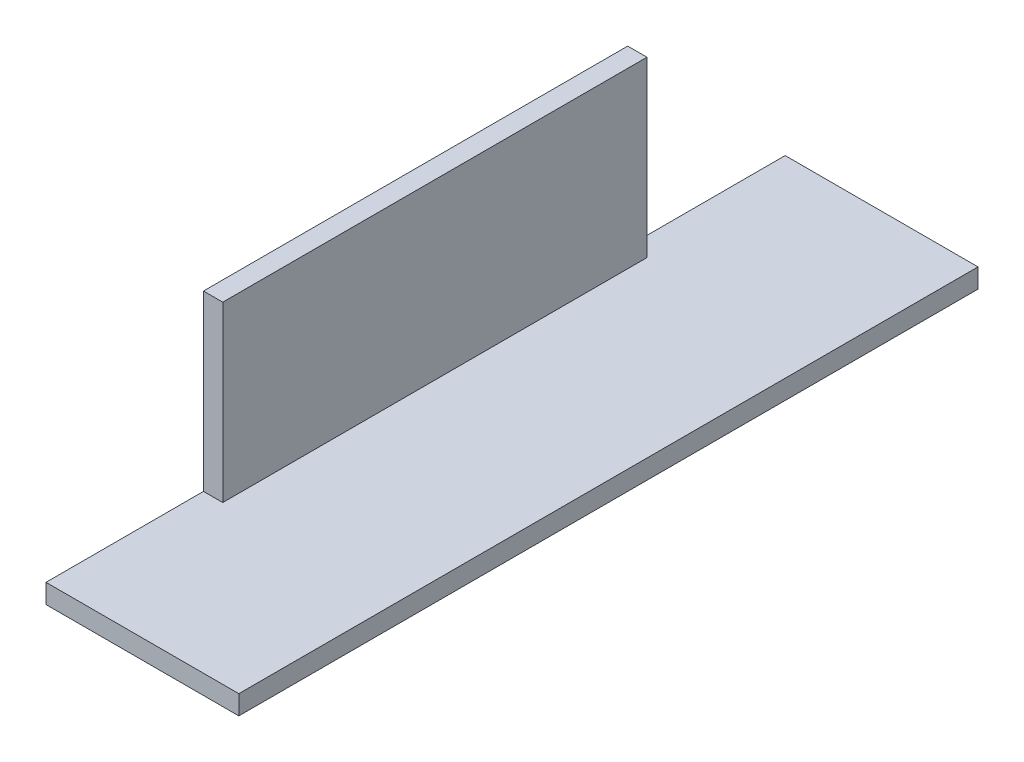
ISO-10303-21;
HEADER;
FILE_DESCRIPTION(('STEP AP214'),'2;1');
FILE_NAME('part.step','',(''),(''),'','','');
FILE_SCHEMA(('AUTOMOTIVE_DESIGN { 1 0 10303 214 1 1 1 1 }'));
ENDSEC;
DATA;
#1=APPLICATION_CONTEXT('core data for automotive mechanical design processes');
#2=APPLICATION_PROTOCOL_DEFINITION('international standard','automotive_design',2000,#1);
#3=PRODUCT_CONTEXT('',#1,'mechanical');
#4=PRODUCT('Part','Part','',(#3));
#5=PRODUCT_RELATED_PRODUCT_CATEGORY('part','',(#4));
#6=PRODUCT_DEFINITION_FORMATION('','',#4);
#7=PRODUCT_DEFINITION_CONTEXT('part definition',#1,'design');
#8=PRODUCT_DEFINITION('design','',#6,#7);
#9=PRODUCT_DEFINITION_SHAPE('','',#8);
#10=(LENGTH_UNIT() NAMED_UNIT(*) SI_UNIT(.MILLI.,.METRE.));
#11=(NAMED_UNIT(*) PLANE_ANGLE_UNIT() SI_UNIT($,.RADIAN.));
#12=(NAMED_UNIT(*) SI_UNIT($,.STERADIAN.) SOLID_ANGLE_UNIT());
#13=UNCERTAINTY_MEASURE_WITH_UNIT(LENGTH_MEASURE(1.E-05),#10,'distance_accuracy_value','');
#14=(GEOMETRIC_REPRESENTATION_CONTEXT(3) GLOBAL_UNCERTAINTY_ASSIGNED_CONTEXT((#13)) GLOBAL_UNIT_ASSIGNED_CONTEXT((#10,
#11,#12)) REPRESENTATION_CONTEXT('',''));
#15=CARTESIAN_POINT('',(0.,0.,0.));
#16=DIRECTION('',(0.,0.,1.));
#17=DIRECTION('',(1.,0.,0.));
#18=AXIS2_PLACEMENT_3D('',#15,#16,#17);
#19=CARTESIAN_POINT('',(0.,30.,115.));
#20=DIRECTION('',(0.,-1.,0.));
#21=DIRECTION('',(0.,0.,-1.));
#22=AXIS2_PLACEMENT_3D('',#19,#20,#21);
#23=PLANE('',#22);
#24=DIRECTION('',(0.,0.,-1.));
#25=VECTOR('',#24,1.);
#26=CARTESIAN_POINT('',(3.,30.,115.));
#27=LINE('',#26,#25);
#28=CARTESIAN_POINT('',(3.,30.,90.5));
#29=VERTEX_POINT('',#28);
#30=CARTESIAN_POINT('',(3.,30.,24.5));
#31=VERTEX_POINT('',#30);
#32=EDGE_CURVE('E145',#29,#31,#27,.T.);
#33=ORIENTED_EDGE('',*,*,#32,.T.);
#34=DIRECTION('',(-1.,0.,0.));
#35=VECTOR('',#34,1.);
#36=CARTESIAN_POINT('',(30.,30.,24.5));
#37=LINE('',#36,#35);
#38=CARTESIAN_POINT('',(0.,30.,24.5));
#39=VERTEX_POINT('',#38);
#40=EDGE_CURVE('E132',#31,#39,#37,.T.);
#41=ORIENTED_EDGE('',*,*,#40,.T.);
#42=DIRECTION('',(0.,0.,-1.));
#43=VECTOR('',#42,1.);
#44=CARTESIAN_POINT('',(0.,30.,115.));
#45=LINE('',#44,#43);
#46=CARTESIAN_POINT('',(0.,30.,90.5));
#47=VERTEX_POINT('',#46);
#48=EDGE_CURVE('E162',#47,#39,#45,.T.);
#49=ORIENTED_EDGE('',*,*,#48,.F.);
#50=DIRECTION('',(-1.,0.,0.));
#51=VECTOR('',#50,1.);
#52=CARTESIAN_POINT('',(30.,30.,90.5));
#53=LINE('',#52,#51);
#54=EDGE_CURVE('E185',#29,#47,#53,.T.);
#55=ORIENTED_EDGE('',*,*,#54,.F.);
#56=EDGE_LOOP('',(#33,#41,#49,#55));
#57=FACE_BOUND('',#56,.T.);
#58=ADVANCED_FACE('F38',(#57),#23,.F.);
#59=CARTESIAN_POINT('',(0.,30.,115.));
#60=DIRECTION('',(1.,0.,0.));
#61=DIRECTION('',(0.,1.,0.));
#62=AXIS2_PLACEMENT_3D('',#59,#60,#61);
#63=PLANE('',#62);
#64=ORIENTED_EDGE('',*,*,#48,.T.);
#65=DIRECTION('',(0.,1.,0.));
#66=VECTOR('',#65,1.);
#67=CARTESIAN_POINT('',(0.,30.,24.5));
#68=LINE('',#67,#66);
#69=CARTESIAN_POINT('',(0.,3.,24.5));
#70=VERTEX_POINT('',#69);
#71=EDGE_CURVE('E124',#70,#39,#68,.T.);
#72=ORIENTED_EDGE('',*,*,#71,.F.);
#73=DIRECTION('',(0.,0.,1.));
#74=VECTOR('',#73,1.);
#75=CARTESIAN_POINT('',(0.,3.,0.));
#76=LINE('',#75,#74);
#77=CARTESIAN_POINT('',(0.,3.,0.));
#78=VERTEX_POINT('',#77);
#79=EDGE_CURVE('E111',#78,#70,#76,.T.);
#80=ORIENTED_EDGE('',*,*,#79,.F.);
#81=DIRECTION('',(0.,-1.,0.));
#82=VECTOR('',#81,1.);
#83=CARTESIAN_POINT('',(0.,30.,0.));
#84=LINE('',#83,#82);
#85=CARTESIAN_POINT('',(0.,0.,0.));
#86=VERTEX_POINT('',#85);
#87=EDGE_CURVE('E122',#78,#86,#84,.T.);
#88=ORIENTED_EDGE('',*,*,#87,.T.);
#89=DIRECTION('',(0.,0.,-1.));
#90=VECTOR('',#89,1.);
#91=CARTESIAN_POINT('',(0.,0.,115.));
#92=LINE('',#91,#90);
#93=CARTESIAN_POINT('',(0.,0.,115.));
#94=VERTEX_POINT('',#93);
#95=EDGE_CURVE('E159',#94,#86,#92,.T.);
#96=ORIENTED_EDGE('',*,*,#95,.F.);
#97=DIRECTION('',(0.,-1.,0.));
#98=VECTOR('',#97,1.);
#99=CARTESIAN_POINT('',(0.,30.,115.));
#100=LINE('',#99,#98);
#101=CARTESIAN_POINT('',(0.,3.00000000000001,115.));
#102=VERTEX_POINT('',#101);
#103=EDGE_CURVE('E78',#102,#94,#100,.T.);
#104=ORIENTED_EDGE('',*,*,#103,.F.);
#105=DIRECTION('',(0.,0.,1.));
#106=VECTOR('',#105,1.);
#107=CARTESIAN_POINT('',(0.,3.00000000000003,115.));
#108=LINE('',#107,#106);
#109=CARTESIAN_POINT('',(0.,3.00000000000001,90.5));
#110=VERTEX_POINT('',#109);
#111=EDGE_CURVE('E182',#110,#102,#108,.T.);
#112=ORIENTED_EDGE('',*,*,#111,.F.);
#113=DIRECTION('',(0.,-1.,0.));
#114=VECTOR('',#113,1.);
#115=CARTESIAN_POINT('',(0.,30.,90.5));
#116=LINE('',#115,#114);
#117=EDGE_CURVE('E179',#47,#110,#116,.T.);
#118=ORIENTED_EDGE('',*,*,#117,.F.);
#119=EDGE_LOOP('',(#64,#72,#80,#88,#96,#104,#112,#118));
#120=FACE_BOUND('',#119,.T.);
#121=ADVANCED_FACE('F121',(#120),#63,.F.);
#122=CARTESIAN_POINT('',(0.,0.,115.));
#123=DIRECTION('',(0.,1.,0.));
#124=DIRECTION('',(0.,0.,1.));
#125=AXIS2_PLACEMENT_3D('',#122,#123,#124);
#126=PLANE('',#125);
#127=DIRECTION('',(1.,0.,0.));
#128=VECTOR('',#127,1.);
#129=CARTESIAN_POINT('',(0.,0.,0.));
#130=LINE('',#129,#128);
#131=CARTESIAN_POINT('',(30.,0.,0.));
#132=VERTEX_POINT('',#131);
#133=EDGE_CURVE('E130',#86,#132,#130,.T.);
#134=ORIENTED_EDGE('',*,*,#133,.T.);
#135=DIRECTION('',(0.,0.,-1.));
#136=VECTOR('',#135,1.);
#137=CARTESIAN_POINT('',(30.,0.,115.));
#138=LINE('',#137,#136);
#139=CARTESIAN_POINT('',(30.,0.,115.));
#140=VERTEX_POINT('',#139);
#141=EDGE_CURVE('E155',#140,#132,#138,.T.);
#142=ORIENTED_EDGE('',*,*,#141,.F.);
#143=DIRECTION('',(1.,0.,0.));
#144=VECTOR('',#143,1.);
#145=CARTESIAN_POINT('',(0.,0.,115.));
#146=LINE('',#145,#144);
#147=EDGE_CURVE('E192',#94,#140,#146,.T.);
#148=ORIENTED_EDGE('',*,*,#147,.F.);
#149=ORIENTED_EDGE('',*,*,#95,.T.);
#150=EDGE_LOOP('',(#134,#142,#148,#149));
#151=FACE_BOUND('',#150,.T.);
#152=ADVANCED_FACE('F200',(#151),#126,.F.);
#153=CARTESIAN_POINT('',(30.,3.,115.));
#154=DIRECTION('',(-1.,0.,0.));
#155=DIRECTION('',(0.,0.,1.));
#156=AXIS2_PLACEMENT_3D('',#153,#154,#155);
#157=PLANE('',#156);
#158=DIRECTION('',(0.,1.,0.));
#159=VECTOR('',#158,1.);
#160=CARTESIAN_POINT('',(30.,3.,0.));
#161=LINE('',#160,#159);
#162=CARTESIAN_POINT('',(30.,3.,0.));
#163=VERTEX_POINT('',#162);
#164=EDGE_CURVE('E117',#132,#163,#161,.T.);
#165=ORIENTED_EDGE('',*,*,#164,.T.);
#166=DIRECTION('',(0.,0.,-1.));
#167=VECTOR('',#166,1.);
#168=CARTESIAN_POINT('',(30.,3.,115.));
#169=LINE('',#168,#167);
#170=CARTESIAN_POINT('',(30.,3.,115.));
#171=VERTEX_POINT('',#170);
#172=EDGE_CURVE('E75',#171,#163,#169,.T.);
#173=ORIENTED_EDGE('',*,*,#172,.F.);
#174=DIRECTION('',(0.,1.,0.));
#175=VECTOR('',#174,1.);
#176=CARTESIAN_POINT('',(30.,3.,115.));
#177=LINE('',#176,#175);
#178=EDGE_CURVE('E59',#140,#171,#177,.T.);
#179=ORIENTED_EDGE('',*,*,#178,.F.);
#180=ORIENTED_EDGE('',*,*,#141,.T.);
#181=EDGE_LOOP('',(#165,#173,#179,#180));
#182=FACE_BOUND('',#181,.T.);
#183=ADVANCED_FACE('F202',(#182),#157,.F.);
#184=CARTESIAN_POINT('',(3.,3.,115.));
#185=DIRECTION('',(0.,-1.,0.));
#186=DIRECTION('',(0.,0.,-1.));
#187=AXIS2_PLACEMENT_3D('',#184,#185,#186);
#188=PLANE('',#187);
#189=ORIENTED_EDGE('',*,*,#172,.T.);
#190=DIRECTION('',(-1.,0.,0.));
#191=VECTOR('',#190,1.);
#192=CARTESIAN_POINT('',(3.,3.,0.));
#193=LINE('',#192,#191);
#194=EDGE_CURVE('E107',#163,#78,#193,.T.);
#195=ORIENTED_EDGE('',*,*,#194,.T.);
#196=ORIENTED_EDGE('',*,*,#79,.T.);
#197=DIRECTION('',(-1.,0.,0.));
#198=VECTOR('',#197,1.);
#199=CARTESIAN_POINT('',(30.,3.,24.5));
#200=LINE('',#199,#198);
#201=CARTESIAN_POINT('',(3.,3.,24.5));
#202=VERTEX_POINT('',#201);
#203=EDGE_CURVE('E138',#202,#70,#200,.T.);
#204=ORIENTED_EDGE('',*,*,#203,.F.);
#205=DIRECTION('',(0.,0.,-1.));
#206=VECTOR('',#205,1.);
#207=CARTESIAN_POINT('',(3.,3.,115.));
#208=LINE('',#207,#206);
#209=CARTESIAN_POINT('',(3.,3.00000000000001,90.5));
#210=VERTEX_POINT('',#209);
#211=EDGE_CURVE('E149',#210,#202,#208,.T.);
#212=ORIENTED_EDGE('',*,*,#211,.F.);
#213=DIRECTION('',(-1.,0.,0.));
#214=VECTOR('',#213,1.);
#215=CARTESIAN_POINT('',(30.,3.00000000000001,90.5));
#216=LINE('',#215,#214);
#217=EDGE_CURVE('E126',#210,#110,#216,.T.);
#218=ORIENTED_EDGE('',*,*,#217,.T.);
#219=ORIENTED_EDGE('',*,*,#111,.T.);
#220=DIRECTION('',(-1.,0.,0.));
#221=VECTOR('',#220,1.);
#222=CARTESIAN_POINT('',(3.,3.,115.));
#223=LINE('',#222,#221);
#224=EDGE_CURVE('E53',#171,#102,#223,.T.);
#225=ORIENTED_EDGE('',*,*,#224,.F.);
#226=EDGE_LOOP('',(#189,#195,#196,#204,#212,#218,#219,#225));
#227=FACE_BOUND('',#226,.T.);
#228=ADVANCED_FACE('F109',(#227),#188,.F.);
#229=CARTESIAN_POINT('',(3.,30.,115.));
#230=DIRECTION('',(-1.,0.,0.));
#231=DIRECTION('',(0.,-1.,0.));
#232=AXIS2_PLACEMENT_3D('',#229,#230,#231);
#233=PLANE('',#232);
#234=ORIENTED_EDGE('',*,*,#211,.T.);
#235=DIRECTION('',(0.,1.,0.));
#236=VECTOR('',#235,1.);
#237=CARTESIAN_POINT('',(3.,30.,24.5));
#238=LINE('',#237,#236);
#239=EDGE_CURVE('E11',#202,#31,#238,.T.);
#240=ORIENTED_EDGE('',*,*,#239,.T.);
#241=ORIENTED_EDGE('',*,*,#32,.F.);
#242=DIRECTION('',(0.,-1.,0.));
#243=VECTOR('',#242,1.);
#244=CARTESIAN_POINT('',(3.,30.,90.5));
#245=LINE('',#244,#243);
#246=EDGE_CURVE('E46',#29,#210,#245,.T.);
#247=ORIENTED_EDGE('',*,*,#246,.T.);
#248=EDGE_LOOP('',(#234,#240,#241,#247));
#249=FACE_BOUND('',#248,.T.);
#250=ADVANCED_FACE('F169',(#249),#233,.F.);
#251=CARTESIAN_POINT('',(0.,0.,115.));
#252=DIRECTION('',(0.,0.,-1.));
#253=DIRECTION('',(-1.,0.,0.));
#254=AXIS2_PLACEMENT_3D('',#251,#252,#253);
#255=PLANE('',#254);
#256=ORIENTED_EDGE('',*,*,#224,.T.);
#257=ORIENTED_EDGE('',*,*,#103,.T.);
#258=ORIENTED_EDGE('',*,*,#147,.T.);
#259=ORIENTED_EDGE('',*,*,#178,.T.);
#260=EDGE_LOOP('',(#256,#257,#258,#259));
#261=FACE_BOUND('',#260,.T.);
#262=ADVANCED_FACE('F198',(#261),#255,.F.);
#263=CARTESIAN_POINT('',(0.,0.,0.));
#264=DIRECTION('',(0.,0.,-1.));
#265=DIRECTION('',(-1.,0.,0.));
#266=AXIS2_PLACEMENT_3D('',#263,#264,#265);
#267=PLANE('',#266);
#268=ORIENTED_EDGE('',*,*,#87,.F.);
#269=ORIENTED_EDGE('',*,*,#194,.F.);
#270=ORIENTED_EDGE('',*,*,#164,.F.);
#271=ORIENTED_EDGE('',*,*,#133,.F.);
#272=EDGE_LOOP('',(#268,#269,#270,#271));
#273=FACE_BOUND('',#272,.T.);
#274=ADVANCED_FACE('F129',(#273),#267,.T.);
#275=CARTESIAN_POINT('',(30.,30.,24.5));
#276=DIRECTION('',(0.,0.,1.));
#277=DIRECTION('',(0.,-1.,0.));
#278=AXIS2_PLACEMENT_3D('',#275,#276,#277);
#279=PLANE('',#278);
#280=ORIENTED_EDGE('',*,*,#203,.T.);
#281=ORIENTED_EDGE('',*,*,#71,.T.);
#282=ORIENTED_EDGE('',*,*,#40,.F.);
#283=ORIENTED_EDGE('',*,*,#239,.F.);
#284=EDGE_LOOP('',(#280,#281,#282,#283));
#285=FACE_BOUND('',#284,.T.);
#286=ADVANCED_FACE('F207',(#285),#279,.F.);
#287=CARTESIAN_POINT('',(30.,30.,90.5));
#288=DIRECTION('',(0.,0.,-1.));
#289=DIRECTION('',(-1.,0.,0.));
#290=AXIS2_PLACEMENT_3D('',#287,#288,#289);
#291=PLANE('',#290);
#292=ORIENTED_EDGE('',*,*,#54,.T.);
#293=ORIENTED_EDGE('',*,*,#117,.T.);
#294=ORIENTED_EDGE('',*,*,#217,.F.);
#295=ORIENTED_EDGE('',*,*,#246,.F.);
#296=EDGE_LOOP('',(#292,#293,#294,#295));
#297=FACE_BOUND('',#296,.T.);
#298=ADVANCED_FACE('F209',(#297),#291,.F.);
#299=CLOSED_SHELL('',(#58,#121,#152,#183,#228,#250,#262,#274,#286,#298));
#300=MANIFOLD_SOLID_BREP('B2',#299);
#301=ADVANCED_BREP_SHAPE_REPRESENTATION('',(#18,#300),#14);
#302=SHAPE_DEFINITION_REPRESENTATION(#9,#301);
ENDSEC;
END-ISO-10303-21;
